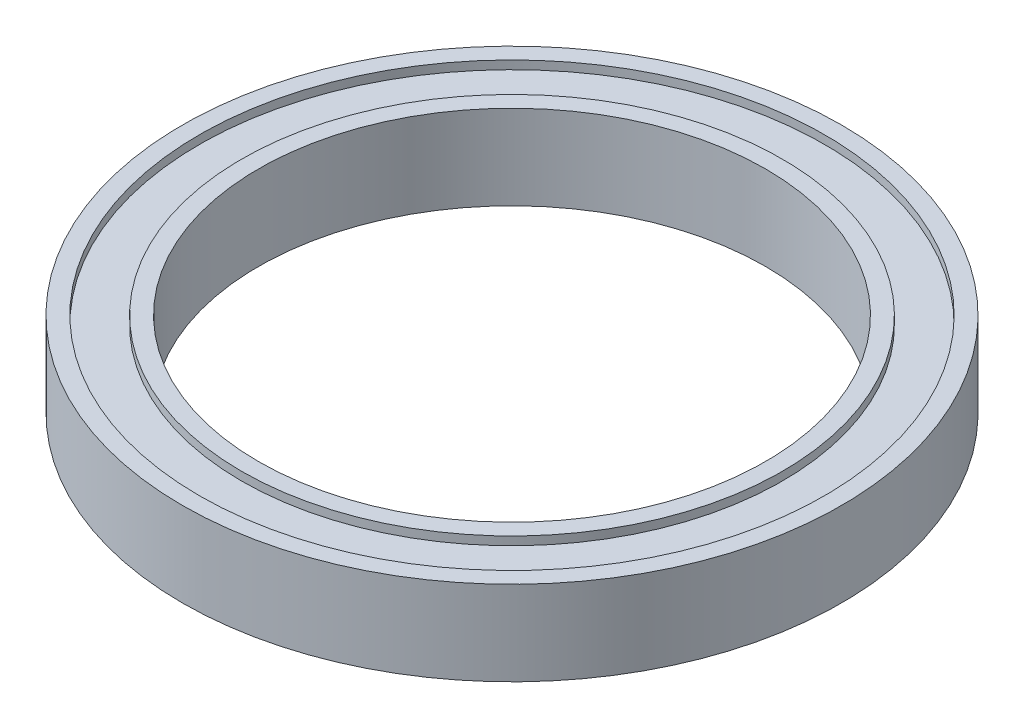
ISO-10303-21;
HEADER;
FILE_DESCRIPTION(('STEP AP214'),'2;1');
FILE_NAME('part.step','',(''),(''),'','','');
FILE_SCHEMA(('AUTOMOTIVE_DESIGN { 1 0 10303 214 1 1 1 1 }'));
ENDSEC;
DATA;
#1=APPLICATION_CONTEXT('core data for automotive mechanical design processes');
#2=APPLICATION_PROTOCOL_DEFINITION('international standard','automotive_design',2000,#1);
#3=PRODUCT_CONTEXT('',#1,'mechanical');
#4=PRODUCT('Part','Part','',(#3));
#5=PRODUCT_RELATED_PRODUCT_CATEGORY('part','',(#4));
#6=PRODUCT_DEFINITION_FORMATION('','',#4);
#7=PRODUCT_DEFINITION_CONTEXT('part definition',#1,'design');
#8=PRODUCT_DEFINITION('design','',#6,#7);
#9=PRODUCT_DEFINITION_SHAPE('','',#8);
#10=(LENGTH_UNIT() NAMED_UNIT(*) SI_UNIT(.MILLI.,.METRE.));
#11=(NAMED_UNIT(*) PLANE_ANGLE_UNIT() SI_UNIT($,.RADIAN.));
#12=(NAMED_UNIT(*) SI_UNIT($,.STERADIAN.) SOLID_ANGLE_UNIT());
#13=UNCERTAINTY_MEASURE_WITH_UNIT(LENGTH_MEASURE(1.E-05),#10,'distance_accuracy_value','');
#14=(GEOMETRIC_REPRESENTATION_CONTEXT(3) GLOBAL_UNCERTAINTY_ASSIGNED_CONTEXT((#13)) GLOBAL_UNIT_ASSIGNED_CONTEXT((#10,
#11,#12)) REPRESENTATION_CONTEXT('',''));
#15=CARTESIAN_POINT('',(0.,0.,0.));
#16=DIRECTION('',(0.,0.,1.));
#17=DIRECTION('',(1.,0.,0.));
#18=AXIS2_PLACEMENT_3D('',#15,#16,#17);
#19=CARTESIAN_POINT('',(0.,0.,0.));
#20=DIRECTION('',(0.,1.,0.));
#21=DIRECTION('',(0.,0.,1.));
#22=AXIS2_PLACEMENT_3D('',#19,#20,#21);
#23=PLANE('',#22);
#24=CARTESIAN_POINT('',(0.,0.,0.));
#25=DIRECTION('',(0.,1.,0.));
#26=DIRECTION('',(0.,0.,1.));
#27=AXIS2_PLACEMENT_3D('',#24,#25,#26);
#28=CIRCLE('',#27,30.);
#29=CARTESIAN_POINT('',(0.,0.,30.));
#30=VERTEX_POINT('',#29);
#31=EDGE_CURVE('E49',#30,#30,#28,.T.);
#32=ORIENTED_EDGE('',*,*,#31,.T.);
#33=EDGE_LOOP('',(#32));
#34=FACE_BOUND('',#33,.T.);
#35=CARTESIAN_POINT('',(0.,0.,0.));
#36=DIRECTION('',(0.,-1.,0.));
#37=DIRECTION('',(0.,0.,-1.));
#38=AXIS2_PLACEMENT_3D('',#35,#36,#37);
#39=CIRCLE('',#38,32.);
#40=CARTESIAN_POINT('',(0.,0.,-32.));
#41=VERTEX_POINT('',#40);
#42=EDGE_CURVE('E73',#41,#41,#39,.T.);
#43=ORIENTED_EDGE('',*,*,#42,.T.);
#44=EDGE_LOOP('',(#43));
#45=FACE_BOUND('',#44,.T.);
#46=ADVANCED_FACE('F36',(#34,#45),#23,.F.);
#47=CARTESIAN_POINT('',(0.,10.,0.));
#48=DIRECTION('',(0.,1.,0.));
#49=DIRECTION('',(0.,0.,1.));
#50=AXIS2_PLACEMENT_3D('',#47,#48,#49);
#51=PLANE('',#50);
#52=CARTESIAN_POINT('',(0.,10.,0.));
#53=DIRECTION('',(0.,1.,0.));
#54=DIRECTION('',(0.,0.,1.));
#55=AXIS2_PLACEMENT_3D('',#52,#53,#54);
#56=CIRCLE('',#55,30.);
#57=CARTESIAN_POINT('',(0.,10.,30.));
#58=VERTEX_POINT('',#57);
#59=EDGE_CURVE('E47',#58,#58,#56,.T.);
#60=ORIENTED_EDGE('',*,*,#59,.F.);
#61=EDGE_LOOP('',(#60));
#62=FACE_BOUND('',#61,.T.);
#63=CARTESIAN_POINT('',(0.,10.,0.));
#64=DIRECTION('',(0.,1.,0.));
#65=DIRECTION('',(0.,0.,1.));
#66=AXIS2_PLACEMENT_3D('',#63,#64,#65);
#67=CIRCLE('',#66,32.);
#68=CARTESIAN_POINT('',(0.,10.,32.));
#69=VERTEX_POINT('',#68);
#70=EDGE_CURVE('E61',#69,#69,#67,.T.);
#71=ORIENTED_EDGE('',*,*,#70,.T.);
#72=EDGE_LOOP('',(#71));
#73=FACE_BOUND('',#72,.T.);
#74=ADVANCED_FACE('F111',(#62,#73),#51,.T.);
#75=CARTESIAN_POINT('',(0.,10.,0.));
#76=DIRECTION('',(0.,1.,0.));
#77=DIRECTION('',(0.,0.,1.));
#78=AXIS2_PLACEMENT_3D('',#75,#76,#77);
#79=CIRCLE('',#78,37.);
#80=CARTESIAN_POINT('',(0.,10.,37.));
#81=VERTEX_POINT('',#80);
#82=EDGE_CURVE('E55',#81,#81,#79,.T.);
#83=ORIENTED_EDGE('',*,*,#82,.F.);
#84=EDGE_LOOP('',(#83));
#85=FACE_BOUND('',#84,.T.);
#86=CARTESIAN_POINT('',(0.,10.,0.));
#87=DIRECTION('',(0.,1.,0.));
#88=DIRECTION('',(0.,0.,1.));
#89=AXIS2_PLACEMENT_3D('',#86,#87,#88);
#90=CIRCLE('',#89,39.);
#91=CARTESIAN_POINT('',(0.,10.,39.));
#92=VERTEX_POINT('',#91);
#93=EDGE_CURVE('E10',#92,#92,#90,.T.);
#94=ORIENTED_EDGE('',*,*,#93,.T.);
#95=EDGE_LOOP('',(#94));
#96=FACE_BOUND('',#95,.T.);
#97=ADVANCED_FACE('F98',(#85,#96),#51,.T.);
#98=CARTESIAN_POINT('',(0.,0.,0.));
#99=DIRECTION('',(0.,-1.,0.));
#100=DIRECTION('',(0.,0.,-1.));
#101=AXIS2_PLACEMENT_3D('',#98,#99,#100);
#102=CIRCLE('',#101,37.);
#103=CARTESIAN_POINT('',(0.,0.,-37.));
#104=VERTEX_POINT('',#103);
#105=EDGE_CURVE('E67',#104,#104,#102,.T.);
#106=ORIENTED_EDGE('',*,*,#105,.F.);
#107=EDGE_LOOP('',(#106));
#108=FACE_BOUND('',#107,.T.);
#109=CARTESIAN_POINT('',(0.,0.,0.));
#110=DIRECTION('',(0.,1.,0.));
#111=DIRECTION('',(0.,0.,1.));
#112=AXIS2_PLACEMENT_3D('',#109,#110,#111);
#113=CIRCLE('',#112,39.);
#114=CARTESIAN_POINT('',(0.,0.,39.));
#115=VERTEX_POINT('',#114);
#116=EDGE_CURVE('E40',#115,#115,#113,.T.);
#117=ORIENTED_EDGE('',*,*,#116,.F.);
#118=EDGE_LOOP('',(#117));
#119=FACE_BOUND('',#118,.T.);
#120=ADVANCED_FACE('F95',(#108,#119),#23,.F.);
#121=CARTESIAN_POINT('',(0.,10.,0.));
#122=DIRECTION('',(0.,-1.,0.));
#123=DIRECTION('',(0.,0.,-1.));
#124=AXIS2_PLACEMENT_3D('',#121,#122,#123);
#125=CYLINDRICAL_SURFACE('',#124,39.);
#126=ORIENTED_EDGE('',*,*,#93,.F.);
#127=EDGE_LOOP('',(#126));
#128=FACE_BOUND('',#127,.T.);
#129=ORIENTED_EDGE('',*,*,#116,.T.);
#130=EDGE_LOOP('',(#129));
#131=FACE_BOUND('',#130,.T.);
#132=ADVANCED_FACE('F38',(#128,#131),#125,.T.);
#133=CARTESIAN_POINT('',(0.,10.,0.));
#134=DIRECTION('',(0.,-1.,0.));
#135=DIRECTION('',(0.,0.,-1.));
#136=AXIS2_PLACEMENT_3D('',#133,#134,#135);
#137=CYLINDRICAL_SURFACE('',#136,30.);
#138=ORIENTED_EDGE('',*,*,#59,.T.);
#139=EDGE_LOOP('',(#138));
#140=FACE_BOUND('',#139,.T.);
#141=ORIENTED_EDGE('',*,*,#31,.F.);
#142=EDGE_LOOP('',(#141));
#143=FACE_BOUND('',#142,.T.);
#144=ADVANCED_FACE('F102',(#140,#143),#137,.F.);
#145=CARTESIAN_POINT('',(0.,9.,0.));
#146=DIRECTION('',(0.,1.,0.));
#147=DIRECTION('',(0.,0.,1.));
#148=AXIS2_PLACEMENT_3D('',#145,#146,#147);
#149=CYLINDRICAL_SURFACE('',#148,37.);
#150=CARTESIAN_POINT('',(0.,9.,0.));
#151=DIRECTION('',(0.,1.,0.));
#152=DIRECTION('',(0.,0.,1.));
#153=AXIS2_PLACEMENT_3D('',#150,#151,#152);
#154=CIRCLE('',#153,37.);
#155=CARTESIAN_POINT('',(0.,9.,37.));
#156=VERTEX_POINT('',#155);
#157=EDGE_CURVE('E52',#156,#156,#154,.T.);
#158=ORIENTED_EDGE('',*,*,#157,.F.);
#159=EDGE_LOOP('',(#158));
#160=FACE_BOUND('',#159,.T.);
#161=ORIENTED_EDGE('',*,*,#82,.T.);
#162=EDGE_LOOP('',(#161));
#163=FACE_BOUND('',#162,.T.);
#164=ADVANCED_FACE('F107',(#160,#163),#149,.F.);
#165=CARTESIAN_POINT('',(0.,9.,0.));
#166=DIRECTION('',(0.,1.,0.));
#167=DIRECTION('',(0.,0.,1.));
#168=AXIS2_PLACEMENT_3D('',#165,#166,#167);
#169=PLANE('',#168);
#170=CARTESIAN_POINT('',(0.,9.,0.));
#171=DIRECTION('',(0.,1.,0.));
#172=DIRECTION('',(0.,0.,1.));
#173=AXIS2_PLACEMENT_3D('',#170,#171,#172);
#174=CIRCLE('',#173,32.);
#175=CARTESIAN_POINT('',(0.,9.,32.));
#176=VERTEX_POINT('',#175);
#177=EDGE_CURVE('E58',#176,#176,#174,.T.);
#178=ORIENTED_EDGE('',*,*,#177,.F.);
#179=EDGE_LOOP('',(#178));
#180=FACE_BOUND('',#179,.T.);
#181=ORIENTED_EDGE('',*,*,#157,.T.);
#182=EDGE_LOOP('',(#181));
#183=FACE_BOUND('',#182,.T.);
#184=ADVANCED_FACE('F124',(#180,#183),#169,.T.);
#185=CARTESIAN_POINT('',(0.,9.,0.));
#186=DIRECTION('',(0.,1.,0.));
#187=DIRECTION('',(0.,0.,1.));
#188=AXIS2_PLACEMENT_3D('',#185,#186,#187);
#189=CYLINDRICAL_SURFACE('',#188,32.);
#190=ORIENTED_EDGE('',*,*,#177,.T.);
#191=EDGE_LOOP('',(#190));
#192=FACE_BOUND('',#191,.T.);
#193=ORIENTED_EDGE('',*,*,#70,.F.);
#194=EDGE_LOOP('',(#193));
#195=FACE_BOUND('',#194,.T.);
#196=ADVANCED_FACE('F91',(#192,#195),#189,.T.);
#197=CARTESIAN_POINT('',(0.,1.,0.));
#198=DIRECTION('',(0.,-1.,0.));
#199=DIRECTION('',(0.,0.,-1.));
#200=AXIS2_PLACEMENT_3D('',#197,#198,#199);
#201=CYLINDRICAL_SURFACE('',#200,37.);
#202=CARTESIAN_POINT('',(0.,1.,0.));
#203=DIRECTION('',(0.,-1.,0.));
#204=DIRECTION('',(0.,0.,-1.));
#205=AXIS2_PLACEMENT_3D('',#202,#203,#204);
#206=CIRCLE('',#205,37.);
#207=CARTESIAN_POINT('',(0.,1.,-37.));
#208=VERTEX_POINT('',#207);
#209=EDGE_CURVE('E64',#208,#208,#206,.T.);
#210=ORIENTED_EDGE('',*,*,#209,.F.);
#211=EDGE_LOOP('',(#210));
#212=FACE_BOUND('',#211,.T.);
#213=ORIENTED_EDGE('',*,*,#105,.T.);
#214=EDGE_LOOP('',(#213));
#215=FACE_BOUND('',#214,.T.);
#216=ADVANCED_FACE('F85',(#212,#215),#201,.F.);
#217=CARTESIAN_POINT('',(0.,1.,0.));
#218=DIRECTION('',(0.,-1.,0.));
#219=DIRECTION('',(0.,0.,-1.));
#220=AXIS2_PLACEMENT_3D('',#217,#218,#219);
#221=PLANE('',#220);
#222=CARTESIAN_POINT('',(0.,1.,0.));
#223=DIRECTION('',(0.,-1.,0.));
#224=DIRECTION('',(0.,0.,-1.));
#225=AXIS2_PLACEMENT_3D('',#222,#223,#224);
#226=CIRCLE('',#225,32.);
#227=CARTESIAN_POINT('',(0.,1.,-32.));
#228=VERTEX_POINT('',#227);
#229=EDGE_CURVE('E70',#228,#228,#226,.T.);
#230=ORIENTED_EDGE('',*,*,#229,.F.);
#231=EDGE_LOOP('',(#230));
#232=FACE_BOUND('',#231,.T.);
#233=ORIENTED_EDGE('',*,*,#209,.T.);
#234=EDGE_LOOP('',(#233));
#235=FACE_BOUND('',#234,.T.);
#236=ADVANCED_FACE('F82',(#232,#235),#221,.T.);
#237=CARTESIAN_POINT('',(0.,1.,0.));
#238=DIRECTION('',(0.,-1.,0.));
#239=DIRECTION('',(0.,0.,-1.));
#240=AXIS2_PLACEMENT_3D('',#237,#238,#239);
#241=CYLINDRICAL_SURFACE('',#240,32.);
#242=ORIENTED_EDGE('',*,*,#229,.T.);
#243=EDGE_LOOP('',(#242));
#244=FACE_BOUND('',#243,.T.);
#245=ORIENTED_EDGE('',*,*,#42,.F.);
#246=EDGE_LOOP('',(#245));
#247=FACE_BOUND('',#246,.T.);
#248=ADVANCED_FACE('F79',(#244,#247),#241,.T.);
#249=CLOSED_SHELL('',(#46,#74,#97,#120,#132,#144,#164,#184,#196,#216,#236,#248));
#250=MANIFOLD_SOLID_BREP('B2',#249);
#251=ADVANCED_BREP_SHAPE_REPRESENTATION('',(#18,#250),#14);
#252=SHAPE_DEFINITION_REPRESENTATION(#9,#251);
ENDSEC;
END-ISO-10303-21;
